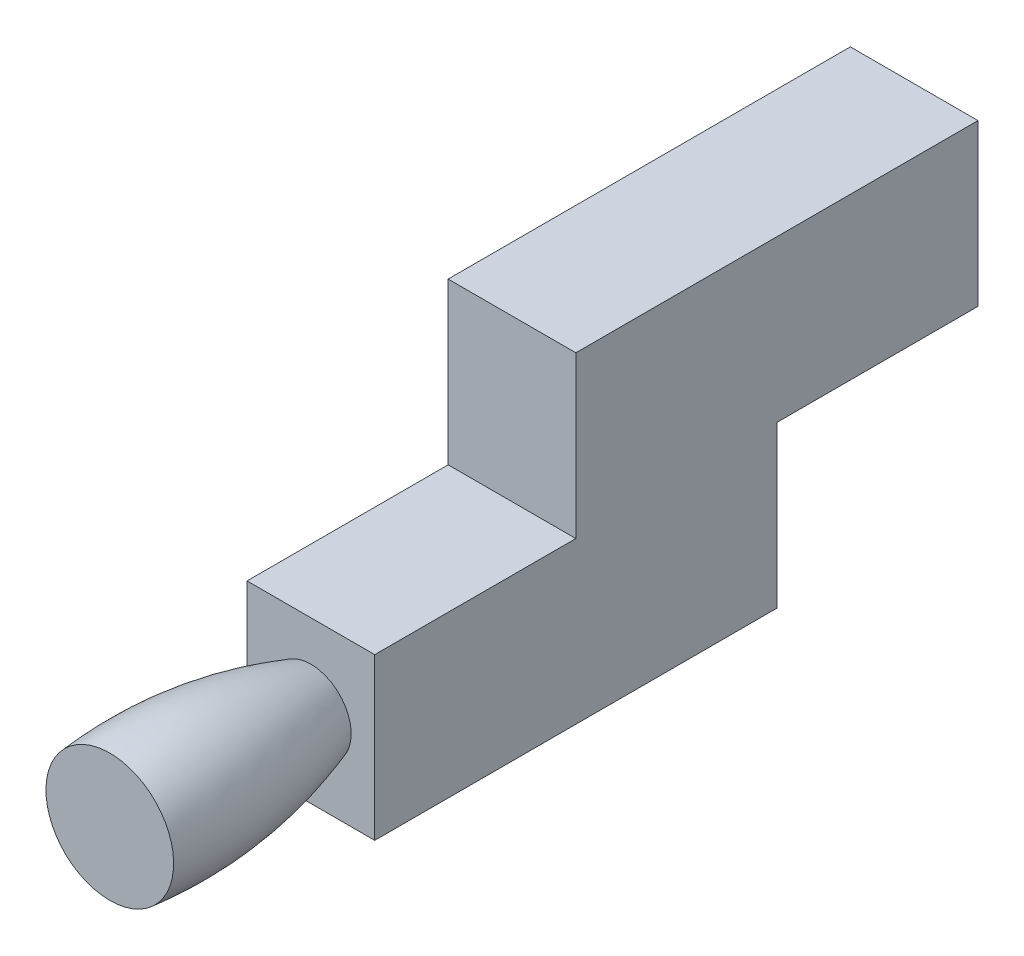
ISO-10303-21;
HEADER;
FILE_DESCRIPTION(('STEP AP214'),'2;1');
FILE_NAME('part.step','',(''),(''),'','','');
FILE_SCHEMA(('AUTOMOTIVE_DESIGN { 1 0 10303 214 1 1 1 1 }'));
ENDSEC;
DATA;
#1=APPLICATION_CONTEXT('core data for automotive mechanical design processes');
#2=APPLICATION_PROTOCOL_DEFINITION('international standard','automotive_design',2000,#1);
#3=PRODUCT_CONTEXT('',#1,'mechanical');
#4=PRODUCT('Part','Part','',(#3));
#5=PRODUCT_RELATED_PRODUCT_CATEGORY('part','',(#4));
#6=PRODUCT_DEFINITION_FORMATION('','',#4);
#7=PRODUCT_DEFINITION_CONTEXT('part definition',#1,'design');
#8=PRODUCT_DEFINITION('design','',#6,#7);
#9=PRODUCT_DEFINITION_SHAPE('','',#8);
#10=(LENGTH_UNIT() NAMED_UNIT(*) SI_UNIT(.MILLI.,.METRE.));
#11=(NAMED_UNIT(*) PLANE_ANGLE_UNIT() SI_UNIT($,.RADIAN.));
#12=(NAMED_UNIT(*) SI_UNIT($,.STERADIAN.) SOLID_ANGLE_UNIT());
#13=UNCERTAINTY_MEASURE_WITH_UNIT(LENGTH_MEASURE(1.E-05),#10,'distance_accuracy_value','');
#14=(GEOMETRIC_REPRESENTATION_CONTEXT(3) GLOBAL_UNCERTAINTY_ASSIGNED_CONTEXT((#13)) GLOBAL_UNIT_ASSIGNED_CONTEXT((#10,
#11,#12)) REPRESENTATION_CONTEXT('',''));
#15=CARTESIAN_POINT('',(0.,0.,0.));
#16=DIRECTION('',(0.,0.,1.));
#17=DIRECTION('',(1.,0.,0.));
#18=AXIS2_PLACEMENT_3D('',#15,#16,#17);
#19=CARTESIAN_POINT('',(0.,0.,5.));
#20=DIRECTION('',(0.,0.,1.));
#21=DIRECTION('',(1.,0.,0.));
#22=AXIS2_PLACEMENT_3D('',#19,#20,#21);
#23=PLANE('',#22);
#24=DIRECTION('',(0.,-1.,0.));
#25=VECTOR('',#24,1.);
#26=CARTESIAN_POINT('',(-0.803970647342905,-1.85226721623948,5.));
#27=LINE('',#26,#25);
#28=CARTESIAN_POINT('',(-0.803970647342905,-1.85226721623948,5.));
#29=VERTEX_POINT('',#28);
#30=CARTESIAN_POINT('',(-0.803970647342905,-5.85226721623948,5.));
#31=VERTEX_POINT('',#30);
#32=EDGE_CURVE('E179',#29,#31,#27,.T.);
#33=ORIENTED_EDGE('',*,*,#32,.T.);
#34=DIRECTION('',(1.,0.,0.));
#35=VECTOR('',#34,1.);
#36=CARTESIAN_POINT('',(-0.803970647342905,-5.85226721623948,5.));
#37=LINE('',#36,#35);
#38=CARTESIAN_POINT('',(2.37102935265709,-5.85226721623948,5.));
#39=VERTEX_POINT('',#38);
#40=EDGE_CURVE('E168',#31,#39,#37,.T.);
#41=ORIENTED_EDGE('',*,*,#40,.T.);
#42=DIRECTION('',(0.,1.,0.));
#43=VECTOR('',#42,1.);
#44=CARTESIAN_POINT('',(2.37102935265709,-1.85226721623948,5.));
#45=LINE('',#44,#43);
#46=CARTESIAN_POINT('',(2.37102935265709,-1.85226721623948,5.));
#47=VERTEX_POINT('',#46);
#48=EDGE_CURVE('E178',#39,#47,#45,.T.);
#49=ORIENTED_EDGE('',*,*,#48,.T.);
#50=DIRECTION('',(-1.,0.,0.));
#51=VECTOR('',#50,1.);
#52=CARTESIAN_POINT('',(-0.803970647342905,-1.85226721623948,5.));
#53=LINE('',#52,#51);
#54=EDGE_CURVE('E184',#47,#29,#53,.T.);
#55=ORIENTED_EDGE('',*,*,#54,.T.);
#56=EDGE_LOOP('',(#33,#41,#49,#55));
#57=FACE_BOUND('',#56,.T.);
#58=CARTESIAN_POINT('',(0.00923727879561479,-3.21824564307174,5.00000000000001));
#59=CARTESIAN_POINT('',(0.0450398333069202,-3.17451698416893,5.));
#60=CARTESIAN_POINT('',(0.0847550880601475,-3.13402880923712,5.));
#61=CARTESIAN_POINT('',(0.170530826366889,-3.0602365633723,5.));
#62=CARTESIAN_POINT('',(0.216607130597872,-3.02695095319399,5.));
#63=CARTESIAN_POINT('',(0.313475834661046,-2.96844564661302,5.));
#64=CARTESIAN_POINT('',(0.364258301595154,-2.94320943978326,5.));
#65=CARTESIAN_POINT('',(0.469251045948581,-2.90145898026304,5.));
#66=CARTESIAN_POINT('',(0.523456262301599,-2.88493217257837,5.));
#67=CARTESIAN_POINT('',(0.60666277098532,-2.86717672723652,5.));
#68=CARTESIAN_POINT('',(0.634946174302572,-2.86242183546317,5.));
#69=CARTESIAN_POINT('',(0.691826244745942,-2.85548191807134,5.));
#70=CARTESIAN_POINT('',(0.72042290325093,-2.85329682190768,5.));
#71=CARTESIAN_POINT('',(0.806356971453538,-2.85056168991217,5.));
#72=CARTESIAN_POINT('',(0.863853981057259,-2.85382853644774,5.));
#73=CARTESIAN_POINT('',(0.975033164307306,-2.86963264291561,5.));
#74=CARTESIAN_POINT('',(1.02877409364747,-2.8817743822195,5.));
#75=CARTESIAN_POINT('',(1.13364167369814,-2.91443586531483,5.));
#76=CARTESIAN_POINT('',(1.18476854845911,-2.93495488973056,5.));
#77=CARTESIAN_POINT('',(1.28556252189465,-2.98527427329888,5.));
#78=CARTESIAN_POINT('',(1.33502521245143,-3.01549134095325,5.));
#79=CARTESIAN_POINT('',(1.40450316952347,-3.06705691798666,5.));
#80=CARTESIAN_POINT('',(1.42688051170033,-3.08528974564922,5.));
#81=CARTESIAN_POINT('',(1.46989658543222,-3.12370307562737,5.));
#82=CARTESIAN_POINT('',(1.49053523715407,-3.14388366728472,5.));
#83=CARTESIAN_POINT('',(1.54768177365626,-3.20487009699664,5.));
#84=CARTESIAN_POINT('',(1.58181726085108,-3.24793851873741,5.));
#85=CARTESIAN_POINT('',(1.64281491446767,-3.33897576132739,5.));
#86=CARTESIAN_POINT('',(1.66966879315488,-3.38695008116108,5.));
#87=CARTESIAN_POINT('',(1.716532958902,-3.48893278445298,5.));
#88=CARTESIAN_POINT('',(1.73615762707549,-3.54311953746418,5.));
#89=CARTESIAN_POINT('',(1.76578415870646,-3.65401081987217,5.));
#90=CARTESIAN_POINT('',(1.77580038017345,-3.71071145966346,5.));
#91=CARTESIAN_POINT('',(1.78528710311074,-3.82345915221293,5.));
#92=CARTESIAN_POINT('',(1.78503138279401,-3.87948338881808,5.));
#93=CARTESIAN_POINT('',(1.77521413258997,-3.99071498187784,5.));
#94=CARTESIAN_POINT('',(1.76564692957116,-4.04592181950449,5.));
#95=CARTESIAN_POINT('',(1.7376863254958,-4.15410273179527,5.));
#96=CARTESIAN_POINT('',(1.71928391786027,-4.20707446792579,5.));
#97=CARTESIAN_POINT('',(1.67409083225169,-4.30928232564291,5.));
#98=CARTESIAN_POINT('',(1.64730981352751,-4.35852266815901,5.));
#99=CARTESIAN_POINT('',(1.60084368846309,-4.42901164089203,5.));
#100=CARTESIAN_POINT('',(1.58405789565584,-4.45221038093529,5.));
#101=CARTESIAN_POINT('',(1.54847799698699,-4.49701017745798,5.));
#102=CARTESIAN_POINT('',(1.52968404160665,-4.51861135344557,5.));
#103=CARTESIAN_POINT('',(1.47054417183962,-4.58083079665835,5.));
#104=CARTESIAN_POINT('',(1.42743415687832,-4.61887417546569,5.));
#105=CARTESIAN_POINT('',(1.33712329410626,-4.685959551508,5.));
#106=CARTESIAN_POINT('',(1.29012144408713,-4.71527266319695,5.));
#107=CARTESIAN_POINT('',(1.19204428317124,-4.76600116143626,5.));
#108=CARTESIAN_POINT('',(1.14096980451628,-4.78741815655342,5.));
#109=CARTESIAN_POINT('',(1.03365214118786,-4.82237450232142,5.));
#110=CARTESIAN_POINT('',(0.977280650523072,-4.83552911432573,5.));
#111=CARTESIAN_POINT('',(0.89170400679566,-4.84748561891553,5.));
#112=CARTESIAN_POINT('',(0.863001299344797,-4.8501749194917,5.));
#113=CARTESIAN_POINT('',(0.805469774718007,-4.85295801263628,5.));
#114=CARTESIAN_POINT('',(0.776640950261009,-4.85305165331852,5.));
#115=CARTESIAN_POINT('',(0.693306408503972,-4.84968703708027,5.));
#116=CARTESIAN_POINT('',(0.638903241779991,-4.84297614930648,5.));
#117=CARTESIAN_POINT('',(0.531831750489037,-4.82100792499866,5.));
#118=CARTESIAN_POINT('',(0.479165315867328,-4.80574158342219,5.));
#119=CARTESIAN_POINT('',(0.374283919292881,-4.76608518451448,5.));
#120=CARTESIAN_POINT('',(0.322228184025024,-4.74127054538754,5.));
#121=CARTESIAN_POINT('',(0.223217883785208,-4.6830621903983,5.));
#122=CARTESIAN_POINT('',(0.176256027183909,-4.64968097402397,5.));
#123=CARTESIAN_POINT('',(0.0903803184011727,-4.5760664710535,5.));
#124=CARTESIAN_POINT('',(0.0512748866508327,-4.53605616344491,5.));
#125=CARTESIAN_POINT('',(-0.0198276199962001,-4.45008639903594,5.));
#126=CARTESIAN_POINT('',(-0.0518140563636663,-4.40411819889973,5.));
#127=CARTESIAN_POINT('',(-0.108097568622908,-4.30734900397755,5.));
#128=CARTESIAN_POINT('',(-0.132349619349792,-4.25652187202995,5.));
#129=CARTESIAN_POINT('',(-0.172172043133923,-4.15160146164441,5.));
#130=CARTESIAN_POINT('',(-0.187753281958004,-4.09751236560438,4.99999999999999));
#131=CARTESIAN_POINT('',(-0.204131225604347,-4.01451380012327,5.));
#132=CARTESIAN_POINT('',(-0.208431138429285,-3.98626209453653,5.));
#133=CARTESIAN_POINT('',(-0.214468437315184,-3.92948618525263,5.));
#134=CARTESIAN_POINT('',(-0.216205811326952,-3.90096198027479,5.));
#135=CARTESIAN_POINT('',(-0.217649536676011,-3.81529153094614,5.));
#136=CARTESIAN_POINT('',(-0.213587981399047,-3.75804492210662,5.));
#137=CARTESIAN_POINT('',(-0.196290993144513,-3.64715207605531,5.));
#138=CARTESIAN_POINT('',(-0.183396377645656,-3.59345072648453,5.));
#139=CARTESIAN_POINT('',(-0.149262486397128,-3.48885411236415,5.));
#140=CARTESIAN_POINT('',(-0.128033798373076,-3.43795538051452,5.));
#141=CARTESIAN_POINT('',(-0.0714650108645722,-3.32848941171724,5.));
#142=CARTESIAN_POINT('',(-0.033962084094523,-3.27100864365722,5.00000000000001));
#143=CARTESIAN_POINT('',(0.00923727879561479,-3.21824564307174,5.00000000000001));
#144=B_SPLINE_CURVE_WITH_KNOTS('',3,(#58,#59,#60,#61,#62,#63,#64,#65,#66,#67,#68,#69,#70,#71,
#72,#73,#74,#75,#76,#77,#78,#79,#80,#81,#82,#83,#84,#85,#86,#87,#88,#89,#90,#91,#92,#93,#94,#95,
#96,#97,#98,#99,#100,#101,#102,#103,#104,#105,#106,#107,#108,#109,#110,#111,#112,#113,#114,#115,
#116,#117,#118,#119,#120,#121,#122,#123,#124,#125,#126,#127,#128,#129,#130,#131,#132,#133,#134,
#135,#136,#137,#138,#139,#140,#141,#142,#143),.UNSPECIFIED.,.T.,.F.,(4,2,2,2,2,2,2,2,2,2,2,2,2,
2,2,2,2,2,2,2,2,2,2,2,2,2,2,2,2,2,2,2,2,2,2,2,2,2,2,2,2,2,4),(0.,0.169304760818923,
0.339038454078839,0.508421727489099,0.677560154639192,0.763499984884317,0.849437455882624,
1.02126553455079,1.18586962325776,1.35045958002529,1.52336885902373,1.60985838481445,
1.69635187966978,1.86043435116214,2.0247028004799,2.19677328809049,2.36858624645384,
2.53582298896264,2.7031616862684,2.8706713314674,3.03798857104247,3.12379240407714,
3.2095898119217,3.38115199246107,3.54663706394365,3.7120884047858,3.8847629388407,
3.97114314066498,4.05752839705391,4.22119766078538,4.38503951902131,4.55721523252543,
4.72914113891467,4.89615574840602,5.06341829097566,5.23163748139131,5.39964539166179,
5.48527518984084,5.57090539065446,5.74215817007147,5.90715009797727,6.07193309255494,
6.27621621987579),.UNSPECIFIED.);
#145=CARTESIAN_POINT('',(1.5572368904326,-4.48581014768877,5.));
#146=VERTEX_POINT('',#145);
#147=EDGE_CURVE('E91',#146,#146,#144,.F.);
#148=ORIENTED_EDGE('',*,*,#147,.F.);
#149=EDGE_LOOP('',(#148));
#150=FACE_BOUND('',#149,.T.);
#151=ADVANCED_FACE('F87',(#57,#150),#23,.T.);
#152=CARTESIAN_POINT('',(-0.803970647342905,-1.85226721623948,-10.));
#153=DIRECTION('',(0.,-1.,0.));
#154=DIRECTION('',(0.,0.,-1.));
#155=AXIS2_PLACEMENT_3D('',#152,#153,#154);
#156=PLANE('',#155);
#157=DIRECTION('',(0.,0.,1.));
#158=VECTOR('',#157,1.);
#159=CARTESIAN_POINT('',(2.37102935265709,-1.85226721623948,-10.));
#160=LINE('',#159,#158);
#161=CARTESIAN_POINT('',(2.37102935265709,-1.85226721623948,-10.));
#162=VERTEX_POINT('',#161);
#163=CARTESIAN_POINT('',(2.37102935265709,-1.85226721623948,-5.));
#164=VERTEX_POINT('',#163);
#165=EDGE_CURVE('E228',#162,#164,#160,.T.);
#166=ORIENTED_EDGE('',*,*,#165,.T.);
#167=DIRECTION('',(-1.,0.,0.));
#168=VECTOR('',#167,1.);
#169=CARTESIAN_POINT('',(-0.803970647342905,-1.85226721623948,-5.));
#170=LINE('',#169,#168);
#171=CARTESIAN_POINT('',(-0.803970647342905,-1.85226721623948,-5.));
#172=VERTEX_POINT('',#171);
#173=EDGE_CURVE('E188',#164,#172,#170,.T.);
#174=ORIENTED_EDGE('',*,*,#173,.T.);
#175=DIRECTION('',(0.,0.,1.));
#176=VECTOR('',#175,1.);
#177=CARTESIAN_POINT('',(-0.803970647342905,-1.85226721623948,-10.));
#178=LINE('',#177,#176);
#179=CARTESIAN_POINT('',(-0.803970647342905,-1.85226721623948,-10.));
#180=VERTEX_POINT('',#179);
#181=EDGE_CURVE('E137',#180,#172,#178,.T.);
#182=ORIENTED_EDGE('',*,*,#181,.F.);
#183=DIRECTION('',(1.,0.,0.));
#184=VECTOR('',#183,1.);
#185=CARTESIAN_POINT('',(-0.803970647342905,-1.85226721623948,-10.));
#186=LINE('',#185,#184);
#187=EDGE_CURVE('E205',#180,#162,#186,.T.);
#188=ORIENTED_EDGE('',*,*,#187,.T.);
#189=EDGE_LOOP('',(#166,#174,#182,#188));
#190=FACE_BOUND('',#189,.T.);
#191=ADVANCED_FACE('F240',(#190),#156,.T.);
#192=CARTESIAN_POINT('',(-0.803970647342905,-1.85226721623948,-10.));
#193=DIRECTION('',(-1.,0.,0.));
#194=DIRECTION('',(0.,0.,1.));
#195=AXIS2_PLACEMENT_3D('',#192,#193,#194);
#196=PLANE('',#195);
#197=DIRECTION('',(0.,-1.,0.));
#198=VECTOR('',#197,1.);
#199=CARTESIAN_POINT('',(-0.803970647342905,-1.85226721623948,0.));
#200=LINE('',#199,#198);
#201=CARTESIAN_POINT('',(-0.803970647342905,2.14773278376052,0.));
#202=VERTEX_POINT('',#201);
#203=CARTESIAN_POINT('',(-0.803970647342905,-1.85226721623948,0.));
#204=VERTEX_POINT('',#203);
#205=EDGE_CURVE('E191',#202,#204,#200,.T.);
#206=ORIENTED_EDGE('',*,*,#205,.F.);
#207=DIRECTION('',(0.,0.,1.));
#208=VECTOR('',#207,1.);
#209=CARTESIAN_POINT('',(-0.803970647342905,2.14773278376052,-10.));
#210=LINE('',#209,#208);
#211=CARTESIAN_POINT('',(-0.803970647342905,2.14773278376052,-10.));
#212=VERTEX_POINT('',#211);
#213=EDGE_CURVE('E12',#212,#202,#210,.T.);
#214=ORIENTED_EDGE('',*,*,#213,.F.);
#215=DIRECTION('',(0.,-1.,0.));
#216=VECTOR('',#215,1.);
#217=CARTESIAN_POINT('',(-0.803970647342905,-1.85226721623948,-10.));
#218=LINE('',#217,#216);
#219=EDGE_CURVE('E202',#212,#180,#218,.T.);
#220=ORIENTED_EDGE('',*,*,#219,.T.);
#221=ORIENTED_EDGE('',*,*,#181,.T.);
#222=DIRECTION('',(0.,-1.,0.));
#223=VECTOR('',#222,1.);
#224=CARTESIAN_POINT('',(-0.803970647342905,-1.85226721623948,-5.));
#225=LINE('',#224,#223);
#226=CARTESIAN_POINT('',(-0.803970647342905,-5.85226721623948,-5.));
#227=VERTEX_POINT('',#226);
#228=EDGE_CURVE('E110',#172,#227,#225,.T.);
#229=ORIENTED_EDGE('',*,*,#228,.T.);
#230=DIRECTION('',(0.,0.,-1.));
#231=VECTOR('',#230,1.);
#232=CARTESIAN_POINT('',(-0.803970647342905,-5.85226721623948,5.));
#233=LINE('',#232,#231);
#234=EDGE_CURVE('E172',#31,#227,#233,.T.);
#235=ORIENTED_EDGE('',*,*,#234,.F.);
#236=ORIENTED_EDGE('',*,*,#32,.F.);
#237=DIRECTION('',(0.,0.,-1.));
#238=VECTOR('',#237,1.);
#239=CARTESIAN_POINT('',(-0.803970647342905,-1.85226721623948,5.));
#240=LINE('',#239,#238);
#241=EDGE_CURVE('E250',#29,#204,#240,.T.);
#242=ORIENTED_EDGE('',*,*,#241,.T.);
#243=EDGE_LOOP('',(#206,#214,#220,#221,#229,#235,#236,#242));
#244=FACE_BOUND('',#243,.T.);
#245=ADVANCED_FACE('F89',(#244),#196,.T.);
#246=CARTESIAN_POINT('',(-0.803970647342905,2.14773278376052,-10.));
#247=DIRECTION('',(0.,1.,0.));
#248=DIRECTION('',(0.,0.,1.));
#249=AXIS2_PLACEMENT_3D('',#246,#247,#248);
#250=PLANE('',#249);
#251=DIRECTION('',(-1.,0.,0.));
#252=VECTOR('',#251,1.);
#253=CARTESIAN_POINT('',(-0.803970647342905,2.14773278376052,0.));
#254=LINE('',#253,#252);
#255=CARTESIAN_POINT('',(2.37102935265709,2.14773278376052,0.));
#256=VERTEX_POINT('',#255);
#257=EDGE_CURVE('E206',#256,#202,#254,.T.);
#258=ORIENTED_EDGE('',*,*,#257,.F.);
#259=DIRECTION('',(0.,0.,1.));
#260=VECTOR('',#259,1.);
#261=CARTESIAN_POINT('',(2.37102935265709,2.14773278376052,-10.));
#262=LINE('',#261,#260);
#263=CARTESIAN_POINT('',(2.37102935265709,2.14773278376052,-10.));
#264=VERTEX_POINT('',#263);
#265=EDGE_CURVE('E102',#264,#256,#262,.T.);
#266=ORIENTED_EDGE('',*,*,#265,.F.);
#267=DIRECTION('',(-1.,0.,0.));
#268=VECTOR('',#267,1.);
#269=CARTESIAN_POINT('',(-0.803970647342905,2.14773278376052,-10.));
#270=LINE('',#269,#268);
#271=EDGE_CURVE('E213',#264,#212,#270,.T.);
#272=ORIENTED_EDGE('',*,*,#271,.T.);
#273=ORIENTED_EDGE('',*,*,#213,.T.);
#274=EDGE_LOOP('',(#258,#266,#272,#273));
#275=FACE_BOUND('',#274,.T.);
#276=ADVANCED_FACE('F236',(#275),#250,.T.);
#277=CARTESIAN_POINT('',(2.37102935265709,-1.85226721623948,-10.));
#278=DIRECTION('',(1.,0.,0.));
#279=DIRECTION('',(0.,0.,-1.));
#280=AXIS2_PLACEMENT_3D('',#277,#278,#279);
#281=PLANE('',#280);
#282=DIRECTION('',(0.,1.,0.));
#283=VECTOR('',#282,1.);
#284=CARTESIAN_POINT('',(2.37102935265709,-1.85226721623948,0.));
#285=LINE('',#284,#283);
#286=CARTESIAN_POINT('',(2.37102935265709,-1.85226721623948,0.));
#287=VERTEX_POINT('',#286);
#288=EDGE_CURVE('E219',#287,#256,#285,.T.);
#289=ORIENTED_EDGE('',*,*,#288,.F.);
#290=DIRECTION('',(0.,0.,-1.));
#291=VECTOR('',#290,1.);
#292=CARTESIAN_POINT('',(2.37102935265709,-1.85226721623948,5.));
#293=LINE('',#292,#291);
#294=EDGE_CURVE('E198',#47,#287,#293,.T.);
#295=ORIENTED_EDGE('',*,*,#294,.F.);
#296=ORIENTED_EDGE('',*,*,#48,.F.);
#297=DIRECTION('',(0.,0.,-1.));
#298=VECTOR('',#297,1.);
#299=CARTESIAN_POINT('',(2.37102935265709,-5.85226721623948,5.));
#300=LINE('',#299,#298);
#301=CARTESIAN_POINT('',(2.37102935265709,-5.85226721623948,-5.));
#302=VERTEX_POINT('',#301);
#303=EDGE_CURVE('E174',#39,#302,#300,.T.);
#304=ORIENTED_EDGE('',*,*,#303,.T.);
#305=DIRECTION('',(0.,1.,0.));
#306=VECTOR('',#305,1.);
#307=CARTESIAN_POINT('',(2.37102935265709,-1.85226721623948,-5.));
#308=LINE('',#307,#306);
#309=EDGE_CURVE('E243',#302,#164,#308,.T.);
#310=ORIENTED_EDGE('',*,*,#309,.T.);
#311=ORIENTED_EDGE('',*,*,#165,.F.);
#312=DIRECTION('',(0.,1.,0.));
#313=VECTOR('',#312,1.);
#314=CARTESIAN_POINT('',(2.37102935265709,-1.85226721623948,-10.));
#315=LINE('',#314,#313);
#316=EDGE_CURVE('E209',#162,#264,#315,.T.);
#317=ORIENTED_EDGE('',*,*,#316,.T.);
#318=ORIENTED_EDGE('',*,*,#265,.T.);
#319=EDGE_LOOP('',(#289,#295,#296,#304,#310,#311,#317,#318));
#320=FACE_BOUND('',#319,.T.);
#321=ADVANCED_FACE('F239',(#320),#281,.T.);
#322=CARTESIAN_POINT('',(0.,0.,-10.));
#323=DIRECTION('',(0.,0.,-1.));
#324=DIRECTION('',(-1.,0.,0.));
#325=AXIS2_PLACEMENT_3D('',#322,#323,#324);
#326=PLANE('',#325);
#327=ORIENTED_EDGE('',*,*,#219,.F.);
#328=ORIENTED_EDGE('',*,*,#271,.F.);
#329=ORIENTED_EDGE('',*,*,#316,.F.);
#330=ORIENTED_EDGE('',*,*,#187,.F.);
#331=EDGE_LOOP('',(#327,#328,#329,#330));
#332=FACE_BOUND('',#331,.T.);
#333=ADVANCED_FACE('F234',(#332),#326,.T.);
#334=CARTESIAN_POINT('',(0.,0.,0.));
#335=DIRECTION('',(0.,0.,-1.));
#336=DIRECTION('',(-1.,0.,0.));
#337=AXIS2_PLACEMENT_3D('',#334,#335,#336);
#338=PLANE('',#337);
#339=ORIENTED_EDGE('',*,*,#205,.T.);
#340=DIRECTION('',(1.,0.,0.));
#341=VECTOR('',#340,1.);
#342=CARTESIAN_POINT('',(-0.803970647342905,-1.85226721623948,0.));
#343=LINE('',#342,#341);
#344=EDGE_CURVE('E196',#204,#287,#343,.T.);
#345=ORIENTED_EDGE('',*,*,#344,.T.);
#346=ORIENTED_EDGE('',*,*,#288,.T.);
#347=ORIENTED_EDGE('',*,*,#257,.T.);
#348=EDGE_LOOP('',(#339,#345,#346,#347));
#349=FACE_BOUND('',#348,.T.);
#350=ADVANCED_FACE('F257',(#349),#338,.F.);
#351=CARTESIAN_POINT('',(-0.803970647342905,-5.85226721623948,5.));
#352=DIRECTION('',(0.,1.,0.));
#353=DIRECTION('',(0.,0.,1.));
#354=AXIS2_PLACEMENT_3D('',#351,#352,#353);
#355=PLANE('',#354);
#356=DIRECTION('',(1.,0.,0.));
#357=VECTOR('',#356,1.);
#358=CARTESIAN_POINT('',(-0.803970647342905,-5.85226721623948,-5.));
#359=LINE('',#358,#357);
#360=EDGE_CURVE('E246',#227,#302,#359,.T.);
#361=ORIENTED_EDGE('',*,*,#360,.T.);
#362=ORIENTED_EDGE('',*,*,#303,.F.);
#363=ORIENTED_EDGE('',*,*,#40,.F.);
#364=ORIENTED_EDGE('',*,*,#234,.T.);
#365=EDGE_LOOP('',(#361,#362,#363,#364));
#366=FACE_BOUND('',#365,.T.);
#367=ADVANCED_FACE('F170',(#366),#355,.F.);
#368=CARTESIAN_POINT('',(-0.803970647342905,-1.85226721623948,5.));
#369=DIRECTION('',(0.,-1.,0.));
#370=DIRECTION('',(0.,0.,-1.));
#371=AXIS2_PLACEMENT_3D('',#368,#369,#370);
#372=PLANE('',#371);
#373=ORIENTED_EDGE('',*,*,#344,.F.);
#374=ORIENTED_EDGE('',*,*,#241,.F.);
#375=ORIENTED_EDGE('',*,*,#54,.F.);
#376=ORIENTED_EDGE('',*,*,#294,.T.);
#377=EDGE_LOOP('',(#373,#374,#375,#376));
#378=FACE_BOUND('',#377,.T.);
#379=ADVANCED_FACE('F255',(#378),#372,.F.);
#380=CARTESIAN_POINT('',(0.,0.,-5.));
#381=DIRECTION('',(0.,0.,1.));
#382=DIRECTION('',(1.,0.,0.));
#383=AXIS2_PLACEMENT_3D('',#380,#381,#382);
#384=PLANE('',#383);
#385=ORIENTED_EDGE('',*,*,#228,.F.);
#386=ORIENTED_EDGE('',*,*,#173,.F.);
#387=ORIENTED_EDGE('',*,*,#309,.F.);
#388=ORIENTED_EDGE('',*,*,#360,.F.);
#389=EDGE_LOOP('',(#385,#386,#387,#388));
#390=FACE_BOUND('',#389,.T.);
#391=ADVANCED_FACE('F276',(#390),#384,.F.);
#392=CARTESIAN_POINT('',(0.783529352657095,-3.85226721623948,10.));
#393=DIRECTION('',(0.,0.,1.));
#394=DIRECTION('',(1.,0.,0.));
#395=AXIS2_PLACEMENT_3D('',#392,#393,#394);
#396=PLANE('',#395);
#397=CARTESIAN_POINT('',(0.783529352657095,-3.85226721623948,10.));
#398=DIRECTION('',(0.,0.,1.));
#399=DIRECTION('',(1.,0.,0.));
#400=AXIS2_PLACEMENT_3D('',#397,#398,#399);
#401=CIRCLE('',#400,1.5875);
#402=CARTESIAN_POINT('',(2.2016070085962,-4.56585814368058,10.));
#403=VERTEX_POINT('',#402);
#404=EDGE_CURVE('E387',#403,#403,#401,.T.);
#405=ORIENTED_EDGE('',*,*,#404,.T.);
#406=EDGE_LOOP('',(#405));
#407=FACE_BOUND('',#406,.T.);
#408=ADVANCED_FACE('F274',(#407),#396,.T.);
#409=CARTESIAN_POINT('',(1.5572368904326,-4.48581014768877,5.));
#410=CARTESIAN_POINT('',(1.80738981158281,-4.62606254933223,5.82320395812726));
#411=CARTESIAN_POINT('',(2.1637193170035,-4.77952064568989,7.47012577957998));
#412=CARTESIAN_POINT('',(2.23696989035855,-4.67942787999343,9.15653729146059));
#413=CARTESIAN_POINT('',(2.2016070085962,-4.56585814368058,10.));
#414=CARTESIAN_POINT('',(1.64016746121177,-4.38453207395652,5.));
#415=CARTESIAN_POINT('',(1.90871251637712,-4.49200137631227,5.82320558731624));
#416=CARTESIAN_POINT('',(2.28507527298629,-4.59887881683171,7.4701241499217));
#417=CARTESIAN_POINT('',(2.34525482268315,-4.48916130082147,9.15653892064958));
#418=CARTESIAN_POINT('',(2.29501583691372,-4.38023222382826,10.));
#419=CARTESIAN_POINT('',(1.76411421280383,-4.14820183120233,5.));
#420=CARTESIAN_POINT('',(2.0571152623836,-4.18337491266711,5.82313934973642));
#421=CARTESIAN_POINT('',(2.45628654338434,-4.18945759941979,7.47019040658142));
#422=CARTESIAN_POINT('',(2.48640119466015,-4.06583178739913,9.15647268306976));
#423=CARTESIAN_POINT('',(2.40802690638145,-3.97190558542965,10.));
#424=CARTESIAN_POINT('',(1.80624296592137,-3.75070040050191,4.99999999999999));
#425=CARTESIAN_POINT('',(2.0886694572422,-3.67092868358398,5.8232690029219));
#426=CARTESIAN_POINT('',(2.45740817294963,-3.52372350445086,7.47006071604902));
#427=CARTESIAN_POINT('',(2.43794850172335,-3.3979429393429,9.15660233625523));
#428=CARTESIAN_POINT('',(2.33016587520893,-3.34121684202581,9.99999999999999));
#429=CARTESIAN_POINT('',(1.68653214039658,-3.36850912253231,5.));
#430=CARTESIAN_POINT('',(1.91836851386545,-3.18588881514388,5.82313017414038));
#431=CARTESIAN_POINT('',(2.20464269450491,-2.90758512939207,7.47019958482053));
#432=CARTESIAN_POINT('',(2.13849570408028,-2.7988477460841,9.15646350747372));
#433=CARTESIAN_POINT('',(2.01672176029269,-2.78794884527127,10.));
#434=CARTESIAN_POINT('',(1.43454088722417,-3.05699251568305,5.));
#435=CARTESIAN_POINT('',(1.57797589745275,-2.80113581530255,5.82328094487644));
#436=CARTESIAN_POINT('',(1.73480792376786,-2.43663805322991,7.47004877065457));
#437=CARTESIAN_POINT('',(1.63212993523157,-2.36146733366902,9.15661427820975));
#438=CARTESIAN_POINT('',(1.5157722630311,-2.39748943003275,9.99999999999999));
#439=CARTESIAN_POINT('',(1.13894711236973,-2.90242800123357,5.));
#440=CARTESIAN_POINT('',(1.19193176740745,-2.61541941982546,5.82314370698217));
#441=CARTESIAN_POINT('',(1.22286628622089,-2.2217973431084,7.47018604808056));
#442=CARTESIAN_POINT('',(1.10268219340049,-2.18418192036594,9.15647704031552));
#443=CARTESIAN_POINT('',(1.00507271194185,-2.25557179690381,10.));
#444=CARTESIAN_POINT('',(0.880774468018493,-2.85062362208929,5.));
#445=CARTESIAN_POINT('',(0.858505984021978,-2.56332720930738,5.82324044262762));
#446=CARTESIAN_POINT('',(0.788030493863905,-2.17995531431705,7.47008928457018));
#447=CARTESIAN_POINT('',(0.663388654770276,-2.17459934532132,9.15657377596096));
#448=CARTESIAN_POINT('',(0.588098481264571,-2.26753181800305,10.));
#449=CARTESIAN_POINT('',(0.486649383953356,-2.84917810461833,5.));
#450=CARTESIAN_POINT('',(0.352165398479023,-2.58028723358923,5.8231354656978));
#451=CARTESIAN_POINT('',(0.133373544897485,-2.23739175029746,7.47019429173883));
#452=CARTESIAN_POINT('',(0.0110785433840726,-2.2810165373003,9.15646879903112));
#453=CARTESIAN_POINT('',(-0.0249809072374278,-2.40027206991351,9.99999999999998));
#454=CARTESIAN_POINT('',(-0.0746680319277114,-3.14954059119561,5.00000000000001));
#455=CARTESIAN_POINT('',(-0.351293254865972,-2.99458010193778,5.82326082089446));
#456=CARTESIAN_POINT('',(-0.74536508838576,-2.8251319641009,7.47006890043333));
#457=CARTESIAN_POINT('',(-0.826526681725305,-2.93601991679377,9.15659415422778));
#458=CARTESIAN_POINT('',(-0.787518172216711,-3.06170031347961,10.));
#459=CARTESIAN_POINT('',(-0.258411549553811,-3.75907581121548,4.99999999999999));
#460=CARTESIAN_POINT('',(-0.557912947827052,-3.78446682674471,5.82315057615863));
#461=CARTESIAN_POINT('',(-0.957273557065504,-3.86079530280045,7.47017917692542));
#462=CARTESIAN_POINT('',(-0.96184008735478,-3.99055392720041,9.15648390949196));
#463=CARTESIAN_POINT('',(-0.864302250297045,-4.06820645217045,9.99999999999999));
#464=CARTESIAN_POINT('',(-0.179254555507575,-4.14517274425649,5.));
#465=CARTESIAN_POINT('',(-0.435999502096793,-4.27616665466236,5.82323045967339));
#466=CARTESIAN_POINT('',(-0.762998646596764,-4.48862149839849,7.47009927039999));
#467=CARTESIAN_POINT('',(-0.72021286362896,-4.60581732958632,9.15656379300674));
#468=CARTESIAN_POINT('',(-0.605574604929456,-4.63964876474958,10.));
#469=CARTESIAN_POINT('',(-0.0775442270507347,-4.38805505541775,5.));
#470=CARTESIAN_POINT('',(-0.294879774480191,-4.58278054584695,5.82314933458924));
#471=CARTESIAN_POINT('',(-0.559887846855747,-4.87532655933422,7.47018041885245));
#472=CARTESIAN_POINT('',(-0.487656409235113,-4.97849981324653,9.15648266792258));
#473=CARTESIAN_POINT('',(-0.366709139765689,-4.9816339116576,10.));
#474=CARTESIAN_POINT('',(0.132288593886059,-4.6473542187743,5.00000000000001));
#475=CARTESIAN_POINT('',(-0.0109088125220108,-4.90339266469539,5.82327518771956));
#476=CARTESIAN_POINT('',(-0.167417182997043,-5.2681296200003,7.47005452946981));
#477=CARTESIAN_POINT('',(-0.0647141563330804,-5.34328484603673,9.15660852105289));
#478=CARTESIAN_POINT('',(0.0515802590307586,-5.30719285398633,9.99999999999998));
#479=CARTESIAN_POINT('',(0.487389554209685,-4.83294919714256,5.));
#480=CARTESIAN_POINT('',(0.452236396058822,-5.12592111836735,5.82313568577393));
#481=CARTESIAN_POINT('',(0.446116308744599,-5.52502073775241,7.47019407159935));
#482=CARTESIAN_POINT('',(0.569746218513943,-5.5551683037434,9.15646901910727));
#483=CARTESIAN_POINT('',(0.6636554533185,-5.476818648878,10.));
#484=CARTESIAN_POINT('',(0.885684823916184,-4.87492219838495,4.99999999999999));
#485=CARTESIAN_POINT('',(0.965233421116434,-5.15736670893804,5.82327467397391));
#486=CARTESIAN_POINT('',(1.1121688089168,-5.52611962731337,7.47005504336342));
#487=CARTESIAN_POINT('',(1.2379428088203,-5.50664812379254,9.15660800730725));
#488=CARTESIAN_POINT('',(1.29474456290614,-5.3988492627812,9.99999999999998));
#489=CARTESIAN_POINT('',(1.26706713718896,-4.75521526303521,5.));
#490=CARTESIAN_POINT('',(1.44971538267787,-4.98708694022624,5.82312957460249));
#491=CARTESIAN_POINT('',(1.72800210741665,-5.27346920109773,7.47020018453111));
#492=CARTESIAN_POINT('',(1.83674413550885,-5.20732686309236,9.15646290793583));
#493=CARTESIAN_POINT('',(1.84762647127263,-5.08555670520507,10.));
#494=CARTESIAN_POINT('',(1.47430631965343,-4.58708822142102,5.));
#495=CARTESIAN_POINT('',(1.7060671067885,-4.76012372235218,5.82320232893827));
#496=CARTESIAN_POINT('',(2.04236336102071,-4.96016247454808,7.47012740923826));
#497=CARTESIAN_POINT('',(2.12868495803394,-4.86969445916539,9.1565356622716));
#498=CARTESIAN_POINT('',(2.10819818027868,-4.75148406353291,10.));
#499=CARTESIAN_POINT('',(1.5572368904326,-4.48581014768877,5.));
#500=CARTESIAN_POINT('',(1.80738981158281,-4.62606254933223,5.82320395812726));
#501=CARTESIAN_POINT('',(2.1637193170035,-4.77952064568989,7.47012577957998));
#502=CARTESIAN_POINT('',(2.23696989035855,-4.67942787999343,9.15653729146059));
#503=CARTESIAN_POINT('',(2.2016070085962,-4.56585814368058,10.));
#504=B_SPLINE_SURFACE_WITH_KNOTS('',3,3,((#409,#410,#411,#412,#413),(#414,#415,#416,#417,#418),
(#419,#420,#421,#422,#423),(#424,#425,#426,#427,#428),(#429,#430,#431,#432,#433),(#434,#435,
#436,#437,#438),(#439,#440,#441,#442,#443),(#444,#445,#446,#447,#448),(#449,#450,#451,#452,
#453),(#454,#455,#456,#457,#458),(#459,#460,#461,#462,#463),(#464,#465,#466,#467,#468),(#469,
#470,#471,#472,#473),(#474,#475,#476,#477,#478),(#479,#480,#481,#482,#483),(#484,#485,#486,#487,
#488),(#489,#490,#491,#492,#493),(#494,#495,#496,#497,#498),(#499,#500,#501,#502,#503)),
.UNSPECIFIED.,.T.,.F.,.F.,(4,1,1,1,1,1,1,1,1,1,1,1,1,1,1,1,4),(4,1,4),(0.,0.0625,0.125,0.1875,
0.25,0.3125,0.34375,0.375,0.5,0.625,0.65625,0.6875,0.75,0.8125,0.875,0.9375,1.),(0.,
0.506000112839217,1.),.UNSPECIFIED.);
#505=CARTESIAN_POINT('',(1.5572368904326,-4.48581014768877,5.));
#506=CARTESIAN_POINT('',(1.56109778277931,-4.48797482134838,5.01270543510637));
#507=CARTESIAN_POINT('',(1.56494343997294,-4.49012536936516,5.02541790691619));
#508=CARTESIAN_POINT('',(1.5726014105635,-4.4943965809425,5.05084769413656));
#509=CARTESIAN_POINT('',(1.57641374591591,-4.49651726484869,5.06356499951817));
#510=CARTESIAN_POINT('',(1.58400505358607,-4.5007287312456,5.08900445378092));
#511=CARTESIAN_POINT('',(1.58778404762317,-4.50281953385244,5.10172659285054));
#512=CARTESIAN_POINT('',(1.59530865358611,-4.50697122087355,5.12717571398011));
#513=CARTESIAN_POINT('',(1.59905428699135,-4.50903212517113,5.13990268644542));
#514=CARTESIAN_POINT('',(1.60651215257545,-4.51312399875189,5.16536147396745));
#515=CARTESIAN_POINT('',(1.61022440599013,-4.51515498768244,5.17809327964545));
#516=CARTESIAN_POINT('',(1.61761549249294,-4.51918701372329,5.2035617331655));
#517=CARTESIAN_POINT('',(1.62129434656962,-4.52118807024184,5.21629837184387));
#518=CARTESIAN_POINT('',(1.62861861529694,-4.5251602146526,5.24177649094608));
#519=CARTESIAN_POINT('',(1.63226405068518,-4.52713132171079,5.25451796242028));
#520=CARTESIAN_POINT('',(1.63952146294061,-4.53104355039874,5.28000574669448));
#521=CARTESIAN_POINT('',(1.64313346029077,-4.5329846909491,5.29275205075786));
#522=CARTESIAN_POINT('',(1.65032397737847,-4.53683696982223,5.31824949979232));
#523=CARTESIAN_POINT('',(1.6539025173407,-4.53874812681707,5.33100063623871));
#524=CARTESIAN_POINT('',(1.66102610056471,-4.54254042178318,5.35650774962208));
#525=CARTESIAN_POINT('',(1.66457116378921,-4.54442157817486,5.36926371824514));
#526=CARTESIAN_POINT('',(1.67162777445359,-4.54815385514181,5.39478049556591));
#527=CARTESIAN_POINT('',(1.67513934159056,-4.5500049938827,5.40754129615931));
#528=CARTESIAN_POINT('',(1.68212894099937,-4.55367721875832,5.43306773700599));
#529=CARTESIAN_POINT('',(1.68560699269901,-4.5554983228008,5.44583336936331));
#530=CARTESIAN_POINT('',(1.69252954215629,-4.55911046149293,5.47136947332437));
#531=CARTESIAN_POINT('',(1.69597405906881,-4.56090151378939,5.48413993723918));
#532=CARTESIAN_POINT('',(1.70282951987862,-4.56445353220588,5.50968570390303));
#533=CARTESIAN_POINT('',(1.70624048265424,-4.5662145157087,5.52246099916884));
#534=CARTESIAN_POINT('',(1.71302881612063,-4.56970637975742,5.5480164281239));
#535=CARTESIAN_POINT('',(1.71640620540956,-4.57143727741901,5.56079655453416));
#536=CARTESIAN_POINT('',(1.72312737283659,-4.57486895300779,5.5863616453688));
#537=CARTESIAN_POINT('',(1.72647116928906,-4.57656974778056,5.59914660271695));
#538=CARTESIAN_POINT('',(1.73312513198078,-4.57994120081728,5.6247213550195));
#539=CARTESIAN_POINT('',(1.73643531624702,-4.58161187565366,5.63751114309892));
#540=CARTESIAN_POINT('',(1.7430220355075,-4.58492307204618,5.66309555645768));
#541=CARTESIAN_POINT('',(1.74629858823775,-4.58656360989859,5.67589017506171));
#542=CARTESIAN_POINT('',(1.75281802537104,-4.58981451555478,5.70148424906495));
#543=CARTESIAN_POINT('',(1.75606092721555,-4.59142489937567,5.71428369798688));
#544=CARTESIAN_POINT('',(1.76251304352573,-4.5946154802034,5.73988743222285));
#545=CARTESIAN_POINT('',(1.76572227513475,-4.59619569294524,5.75269171125592));
#546=CARTESIAN_POINT('',(1.77210703192587,-4.5993259148524,5.77830510531283));
#547=CARTESIAN_POINT('',(1.77528257394967,-4.60087593946765,5.79111421425025));
#548=CARTESIAN_POINT('',(1.7815999325258,-4.60394576836212,5.81673726771626));
#549=CARTESIAN_POINT('',(1.78474176561467,-4.60546558780327,5.8295512063512));
#550=CARTESIAN_POINT('',(1.79099168727988,-4.60847498959295,5.85518391881447));
#551=CARTESIAN_POINT('',(1.79409979208411,-4.60996458681249,5.86800268694003));
#552=CARTESIAN_POINT('',(1.80028223814248,-4.61291352740528,5.89364505798866));
#553=CARTESIAN_POINT('',(1.80335659531235,-4.61437288535573,5.90646865539793));
#554=CARTESIAN_POINT('',(1.80947152706796,-4.61726133065952,5.93212068462));
#555=CARTESIAN_POINT('',(1.81251211725381,-4.61869043229342,5.944949111106));
#556=CARTESIAN_POINT('',(1.81855949601074,-4.62151834821613,5.97061079808957));
#557=CARTESIAN_POINT('',(1.82156629986287,-4.62291717648602,5.98344405344528));
#558=CARTESIAN_POINT('',(1.82754608692522,-4.62568452893558,6.00911539777836));
#559=CARTESIAN_POINT('',(1.83051908509399,-4.62705306679401,6.02195348179673));
#560=CARTESIAN_POINT('',(1.83643124176584,-4.62975982167833,6.04763448306731));
#561=CARTESIAN_POINT('',(1.83937041490161,-4.63109805207789,6.06047739554123));
#562=CARTESIAN_POINT('',(1.84521490248706,-4.63374417530493,6.08616805333725));
#563=CARTESIAN_POINT('',(1.84812023124019,-4.63505208119821,6.09901579405959));
#564=CARTESIAN_POINT('',(1.85389701104335,-4.63763753867589,6.12471610796898));
#565=CARTESIAN_POINT('',(1.85676847606423,-4.63891510301551,6.13756867673254));
#566=CARTESIAN_POINT('',(1.86247750938921,-4.6414398606518,6.1632786463432));
#567=CARTESIAN_POINT('',(1.86531509132825,-4.64268706639039,6.17613604294074));
#568=CARTESIAN_POINT('',(1.87095633947917,-4.64515109009324,6.20185566784053));
#569=CARTESIAN_POINT('',(1.87376001898678,-4.64636792018347,6.21471789206478));
#570=CARTESIAN_POINT('',(1.87933344326777,-4.64877117586085,6.24044717184152));
#571=CARTESIAN_POINT('',(1.8821032009944,-4.64995761325538,6.25331422348518));
#572=CARTESIAN_POINT('',(1.88760876270958,-4.65230006681527,6.27905315772667));
#573=CARTESIAN_POINT('',(1.89034457930569,-4.6534560944668,6.29192503658237));
#574=CARTESIAN_POINT('',(1.89578223975921,-4.6557377118172,6.31767362487637));
#575=CARTESIAN_POINT('',(1.89848409587528,-4.65686331267844,6.33055033073672));
#576=CARTESIAN_POINT('',(1.90385381637128,-4.65908405972734,6.35630857267098));
#577=CARTESIAN_POINT('',(1.9065216926578,-4.66017921675103,6.36919010532852));
#578=CARTESIAN_POINT('',(1.91182343450044,-4.66233905940645,6.39495800049074));
#579=CARTESIAN_POINT('',(1.91445731160793,-4.66340375554535,6.407844359738));
#580=CARTESIAN_POINT('',(1.91969103610139,-4.6655026597153,6.43362190771586));
#581=CARTESIAN_POINT('',(1.92229089468039,-4.6665368779222,6.44651309334531));
#582=CARTESIAN_POINT('',(1.92745656312883,-4.66857480951471,6.47230029372646));
#583=CARTESIAN_POINT('',(1.93002238382991,-4.66957853274243,6.48519630553054));
#584=CARTESIAN_POINT('',(1.93511995753751,-4.67155545766555,6.51099315790259));
#585=CARTESIAN_POINT('',(1.93765172101126,-4.67252866886689,6.52389399567369));
#586=CARTESIAN_POINT('',(1.94268116128222,-4.67444455302867,6.54970049962424));
#587=CARTESIAN_POINT('',(1.94517884817924,-4.67538723515652,6.56260616315471));
#588=CARTESIAN_POINT('',(1.95014011631777,-4.67724204446503,6.58842231827131));
#589=CARTESIAN_POINT('',(1.9526037072887,-4.67815418047225,6.60133280735348));
#590=CARTESIAN_POINT('',(1.957496764599,-4.67994788083557,6.62715861322366));
#591=CARTESIAN_POINT('',(1.95992624029451,-4.68082945367507,6.6400739276498));
#592=CARTESIAN_POINT('',(1.96475104808082,-4.68256201100129,6.66590938386106));
#593=CARTESIAN_POINT('',(1.96714638915158,-4.68341300362601,6.67882952342341));
#594=CARTESIAN_POINT('',(1.97190290871813,-4.68508438382324,6.70467462956323));
#595=CARTESIAN_POINT('',(1.97426409581486,-4.68590477918614,6.71759959405398));
#596=CARTESIAN_POINT('',(1.9789522884659,-4.68751494816248,6.74345434970981));
#597=CARTESIAN_POINT('',(1.98127930223934,-4.68830472921656,6.75638413892113));
#598=CARTESIAN_POINT('',(1.98589912927913,-4.68985365288014,6.78224854368038));
#599=CARTESIAN_POINT('',(1.98819195038005,-4.69061280257841,6.79518315740439));
#600=CARTESIAN_POINT('',(1.99274337311286,-4.69210044683739,6.82105721085446));
#601=CARTESIAN_POINT('',(1.99500198219205,-4.69282894813289,6.83399664888325));
#602=CARTESIAN_POINT('',(1.99948496192217,-4.69425527889542,6.8598803506115));
#603=CARTESIAN_POINT('',(2.00170933963045,-4.69495311474122,6.87282461273712));
#604=CARTESIAN_POINT('',(2.00612383766218,-4.69631809791548,6.89871796233088));
#605=CARTESIAN_POINT('',(2.00831396465042,-4.6969852512647,6.91166704834536));
#606=CARTESIAN_POINT('',(2.01265994228806,-4.69828885275887,6.93757004539195));
#607=CARTESIAN_POINT('',(2.01481579920713,-4.69892530656463,6.95052395508725));
#608=CARTESIAN_POINT('',(2.01909321775502,-4.70016749228691,6.97643659917395));
#609=CARTESIAN_POINT('',(2.02121478525584,-4.70077322950238,6.98939533234203));
#610=CARTESIAN_POINT('',(2.02542360601832,-4.70195396536099,7.01531762305611));
#611=CARTESIAN_POINT('',(2.02751086475184,-4.70252896893937,7.02828117948887));
#612=CARTESIAN_POINT('',(2.03165104903325,-4.70364822084253,7.05421311641756));
#613=CARTESIAN_POINT('',(2.03370397965044,-4.70419247373705,7.0671814959069));
#614=CARTESIAN_POINT('',(2.03777548875517,-4.70525020759301,7.0931230786374));
#615=CARTESIAN_POINT('',(2.03979407190705,-4.70576369275693,7.10609628097515));
#616=CARTESIAN_POINT('',(2.04379686713947,-4.70675987447396,7.13204750909467));
#617=CARTESIAN_POINT('',(2.04578108347708,-4.70724257486057,7.14502553407265));
#618=CARTESIAN_POINT('',(2.0497151261416,-4.70817717034694,7.17098640716833));
#619=CARTESIAN_POINT('',(2.05166495631601,-4.70862906890956,7.18396925457832));
#620=CARTESIAN_POINT('',(2.05553020771704,-4.70950204407356,7.20993977223731));
#621=CARTESIAN_POINT('',(2.05744563237938,-4.70992312376556,7.22292744187107));
#622=CARTESIAN_POINT('',(2.06124205382135,-4.71073444451551,7.24890760368048));
#623=CARTESIAN_POINT('',(2.06312305362277,-4.71112468829029,7.26190009532973));
#624=CARTESIAN_POINT('',(2.0668506064101,-4.71187432053448,7.28788990087667));
#625=CARTESIAN_POINT('',(2.06869716200172,-4.71223371134541,7.3008872143331));
#626=CARTESIAN_POINT('',(2.07235580743904,-4.71292162099234,7.32688666320461));
#627=CARTESIAN_POINT('',(2.07416789947232,-4.71325014179309,7.33988879825986));
#628=CARTESIAN_POINT('',(2.07775759886346,-4.71387629475054,7.36589789004309));
#629=CARTESIAN_POINT('',(2.07953520798877,-4.71417392849381,7.37890484648893));
#630=CARTESIAN_POINT('',(2.08305592264066,-4.71473829067233,7.40492358077054));
#631=CARTESIAN_POINT('',(2.08479902951262,-4.71500502031464,7.41793535839809));
#632=CARTESIAN_POINT('',(2.08825072072069,-4.71550755761448,7.44396373476644));
#633=CARTESIAN_POINT('',(2.0899593059782,-4.71574336609825,7.45698033336909));
#634=CARTESIAN_POINT('',(2.09334193508252,-4.71618404445847,7.48301835141851));
#635=CARTESIAN_POINT('',(2.09501597942488,-4.71638891477904,7.49603977079337));
#636=CARTESIAN_POINT('',(2.09832950782331,-4.71676770001055,7.52208743195183));
#637=CARTESIAN_POINT('',(2.09996899194255,-4.71694161497807,7.53511367372657));
#638=CARTESIAN_POINT('',(2.10321338067207,-4.71725847202565,7.56117098503138));
#639=CARTESIAN_POINT('',(2.10481828490164,-4.71740141376486,7.574202054613));
#640=CARTESIAN_POINT('',(2.1079934948035,-4.71765630698942,7.60026902731189));
#641=CARTESIAN_POINT('',(2.10956379964825,-4.71776825773428,7.6133049305372));
#642=CARTESIAN_POINT('',(2.11266979170349,-4.7179611515776,7.63938157631237));
#643=CARTESIAN_POINT('',(2.11420547763796,-4.71804209353487,7.65242231902266));
#644=CARTESIAN_POINT('',(2.11724221280542,-4.71817295241884,7.67850864955959));
#645=CARTESIAN_POINT('',(2.1187432603123,-4.71822286780261,7.69155423759492));
#646=CARTESIAN_POINT('',(2.1217106995568,-4.71829165615447,7.71765026457819));
#647=CARTESIAN_POINT('',(2.12317708911665,-4.71831052717693,7.7307007037789));
#648=CARTESIAN_POINT('',(2.12607519340145,-4.71831720942252,7.7568064388933));
#649=CARTESIAN_POINT('',(2.12750690549547,-4.71830501829642,7.76986173509965));
#650=CARTESIAN_POINT('',(2.13033563578424,-4.71824955886197,7.79597719002989));
#651=CARTESIAN_POINT('',(2.13173265089351,-4.71820628779995,7.80903734908213));
#652=CARTESIAN_POINT('',(2.13449196814987,-4.71808865111162,7.83516253551293));
#653=CARTESIAN_POINT('',(2.13585426675556,-4.71801428232642,7.84822756325129));
#654=CARTESIAN_POINT('',(2.13854413194315,-4.7178344328104,7.87436249286734));
#655=CARTESIAN_POINT('',(2.13987169452647,-4.71772894851478,7.88743239513203));
#656=CARTESIAN_POINT('',(2.14249206860895,-4.7174868505973,7.91357707961801));
#657=CARTESIAN_POINT('',(2.14378487565115,-4.71735023300406,7.92665186224922));
#658=CARTESIAN_POINT('',(2.14633571959222,-4.71704585111135,7.9528063132898));
#659=CARTESIAN_POINT('',(2.14759375157459,-4.71687808243334,7.96588598212772));
#660=CARTESIAN_POINT('',(2.15007502633796,-4.71651138099166,7.99205021140755));
#661=CARTESIAN_POINT('',(2.15129826374185,-4.71631244344178,8.00513477229232));
#662=CARTESIAN_POINT('',(2.15370993029126,-4.7158833868774,8.03130879149605));
#663=CARTESIAN_POINT('',(2.15489835359806,-4.71565326266857,8.04439825026783));
#664=CARTESIAN_POINT('',(2.15724037289725,-4.71516181540781,8.07058207108007));
#665=CARTESIAN_POINT('',(2.1583939625884,-4.71490048675301,8.08367643357899));
#666=CARTESIAN_POINT('',(2.16066629560117,-4.71434661322218,8.10987006768438));
#667=CARTESIAN_POINT('',(2.16178503215815,-4.71405406233442,8.12296933975056));
#668=CARTESIAN_POINT('',(2.1639876398483,-4.71343772695988,8.14917279883369));
#669=CARTESIAN_POINT('',(2.16507150375265,-4.71311393605222,8.16227698630724));
#670=CARTESIAN_POINT('',(2.16720434708399,-4.71243510326032,8.18849028205271));
#671=CARTESIAN_POINT('',(2.16825331881728,-4.71208005454588,8.20159939077374));
#672=CARTESIAN_POINT('',(2.17031635875368,-4.71133868876301,8.22782253486613));
#673=CARTESIAN_POINT('',(2.17133041879755,-4.71095236445492,8.24093657067472));
#674=CARTESIAN_POINT('',(2.17332361630287,-4.7101484301075,8.26716957479861));
#675=CARTESIAN_POINT('',(2.17430274513899,-4.70973081241896,8.28028854353485));
#676=CARTESIAN_POINT('',(2.17622606117713,-4.70886427393341,8.30653141937482));
#677=CARTESIAN_POINT('',(2.17717023928723,-4.70841534507764,8.31965532687878));
#678=CARTESIAN_POINT('',(2.17902363482212,-4.70748616688042,8.34590808611938));
#679=CARTESIAN_POINT('',(2.17993284268796,-4.70700590907072,8.35903693823114));
#680=CARTESIAN_POINT('',(2.18171627868354,-4.70601405558829,8.38529959255692));
#681=CARTESIAN_POINT('',(2.18259049678696,-4.70550245103797,8.39843339511654));
#682=CARTESIAN_POINT('',(2.18430393420719,-4.70444788669684,8.42470595621207));
#683=CARTESIAN_POINT('',(2.18514314303005,-4.70390491761926,8.4378447150596));
#684=CARTESIAN_POINT('',(2.18678654283894,-4.70278760684594,8.46412719460942));
#685=CARTESIAN_POINT('',(2.18759072286316,-4.70221325545451,8.47727091558493));
#686=CARTESIAN_POINT('',(2.18916404602471,-4.70103316267555,8.50356332527357));
#687=CARTESIAN_POINT('',(2.18993317773227,-4.70042741118372,8.51671201421712));
#688=CARTESIAN_POINT('',(2.19143638521053,-4.69918450082568,8.54301436572911));
#689=CARTESIAN_POINT('',(2.19217044908343,-4.69854733144693,8.55616802848076));
#690=CARTESIAN_POINT('',(2.19360350184248,-4.69724156793639,8.58248033350064));
#691=CARTESIAN_POINT('',(2.19430247836279,-4.69657296288428,8.59563897590044));
#692=CARTESIAN_POINT('',(2.1956653373667,-4.69520431064785,8.62196124611275));
#693=CARTESIAN_POINT('',(2.19632920701655,-4.69450425213595,8.63512487400075));
#694=CARTESIAN_POINT('',(2.19762183322945,-4.69307267560025,8.66145712109001));
#695=CARTESIAN_POINT('',(2.19825057649099,-4.69234114584218,8.67462574030628));
#696=CARTESIAN_POINT('',(2.19947293087701,-4.69084660943386,8.70096797595702));
#697=CARTESIAN_POINT('',(2.20006652823246,-4.69008359064329,8.71414159234162));
#698=CARTESIAN_POINT('',(2.20121857175577,-4.68852605878903,8.74049382823837));
#699=CARTESIAN_POINT('',(2.20177700368739,-4.68773153317967,8.75367244763137));
#700=CARTESIAN_POINT('',(2.20285869731218,-4.68611097030615,8.78003469545866));
#701=CARTESIAN_POINT('',(2.20338194430229,-4.68528492009175,8.79321832370014));
#702=CARTESIAN_POINT('',(2.20439324899277,-4.68360129062569,8.81959059514249));
#703=CARTESIAN_POINT('',(2.20488129152372,-4.68274369802005,8.83277923807253));
#704=CARTESIAN_POINT('',(2.20582216824414,-4.68099696638818,8.85916154481448));
#705=CARTESIAN_POINT('',(2.20627498679834,-4.68010781360513,8.87235520827316));
#706=CARTESIAN_POINT('',(2.20714539651295,-4.67829794423421,8.89874756199924));
#707=CARTESIAN_POINT('',(2.20756297157287,-4.67737721348763,8.91194625182667));
#708=CARTESIAN_POINT('',(2.20836287524596,-4.67550417080445,8.93834866422142));
#709=CARTESIAN_POINT('',(2.2087451872941,-4.67455184430826,8.9515523862577));
#710=CARTESIAN_POINT('',(2.20947454588998,-4.6726155927396,8.97796486900567));
#711=CARTESIAN_POINT('',(2.2098215754089,-4.67163165270777,8.99117362909092));
#712=CARTESIAN_POINT('',(2.21048034989191,-4.66963215668046,9.01759619387664));
#713=CARTESIAN_POINT('',(2.2107920773642,-4.66861658532698,9.030809997851));
#714=CARTESIAN_POINT('',(2.21138022869872,-4.66655380926787,9.05724265635902));
#715=CARTESIAN_POINT('',(2.21165663460704,-4.66550658880679,9.07046151006263));
#716=CARTESIAN_POINT('',(2.21217412375743,-4.66338049714273,9.09690427397752));
#717=CARTESIAN_POINT('',(2.21241518858448,-4.66230160978814,9.11012818325052));
#718=CARTESIAN_POINT('',(2.21286197651516,-4.66011216694602,9.13658106425685));
#719=CARTESIAN_POINT('',(2.21306768074369,-4.65900159491204,9.14981003493943));
#720=CARTESIAN_POINT('',(2.21344372841909,-4.65674876531877,9.17627304472176));
#721=CARTESIAN_POINT('',(2.2136140525319,-4.65560649081957,9.18950708265411));
#722=CARTESIAN_POINT('',(2.21391932091649,-4.65329023890206,9.21598023289702));
#723=CARTESIAN_POINT('',(2.2140542453964,-4.65211624415185,9.22921934391934));
#724=CARTESIAN_POINT('',(2.21428869545466,-4.64973653433706,9.25570264630743));
#725=CARTESIAN_POINT('',(2.21438820078458,-4.64853080155008,9.26894683625994));
#726=CARTESIAN_POINT('',(2.214551793481,-4.64608759826496,9.2954403024778));
#727=CARTESIAN_POINT('',(2.21461586014387,-4.64485010965551,9.30868957720074));
#728=CARTESIAN_POINT('',(2.21470855644299,-4.64234337732706,9.33519321893298));
#729=CARTESIAN_POINT('',(2.21473716492178,-4.64107411510944,9.34844758426663));
#730=CARTESIAN_POINT('',(2.21475892578817,-4.63850381816466,9.37496141319787));
#731=CARTESIAN_POINT('',(2.2147520565659,-4.63720276455325,9.38822087498249));
#732=CARTESIAN_POINT('',(2.21470284296412,-4.63456886741917,9.41474490279736));
#733=CARTESIAN_POINT('',(2.21466047652387,-4.63323600462836,9.42800946687327));
#734=CARTESIAN_POINT('',(2.21454024941854,-4.63053847173202,9.45454370525642));
#735=CARTESIAN_POINT('',(2.21446236624343,-4.62917378197626,9.46781337746394));
#736=CARTESIAN_POINT('',(2.21427108659916,-4.62641257774473,9.49435783810002));
#737=CARTESIAN_POINT('',(2.21415766717236,-4.62501604323848,9.50763262427949));
#738=CARTESIAN_POINT('',(2.2138952959538,-4.62219113209884,9.53418731885318));
#739=CARTESIAN_POINT('',(2.21374632075851,-4.62076273505663,9.54746722484499));
#740=CARTESIAN_POINT('',(2.21341281893033,-4.61787408143598,9.57403216504096));
#741=CARTESIAN_POINT('',(2.21322826844981,-4.61641380407236,9.58731719668551));
#742=CARTESIAN_POINT('',(2.21282359697671,-4.61346137239782,9.61389239418846));
#743=CARTESIAN_POINT('',(2.21260345169424,-4.61196919692736,9.62718255732617));
#744=CARTESIAN_POINT('',(2.21212757154095,-4.60895295162609,9.65376802382082));
#745=CARTESIAN_POINT('',(2.21187181193989,-4.60742886026342,9.66706332429214));
#746=CARTESIAN_POINT('',(2.21132468407111,-4.60434876576254,9.69365907146321));
#747=CARTESIAN_POINT('',(2.2110332906348,-4.60279274072229,9.70695951510861));
#748=CARTESIAN_POINT('',(2.2104148760154,-4.59964876144906,9.7335655546409));
#749=CARTESIAN_POINT('',(2.21008782922738,-4.59806078494603,9.74687114730097));
#750=CARTESIAN_POINT('',(2.2093980888218,-4.59485288532737,9.773487490879));
#751=CARTESIAN_POINT('',(2.20903536916511,-4.5932329395759,9.78679823839395));
#752=CARTESIAN_POINT('',(2.20827426393938,-4.58996108404003,9.81342489770342));
#753=CARTESIAN_POINT('',(2.20787585189919,-4.58830915125625,9.82674080591507));
#754=CARTESIAN_POINT('',(2.20704334281357,-4.58497330422668,9.85337779263736));
#755=CARTESIAN_POINT('',(2.20660921886716,-4.5832893666203,9.86669886738164));
#756=CARTESIAN_POINT('',(2.2057052669036,-4.57988949253812,9.8933461932143));
#757=CARTESIAN_POINT('',(2.20523541155795,-4.57817353234291,9.90667244034925));
#758=CARTESIAN_POINT('',(2.20425997761742,-4.57470959558366,9.93333011692957));
#759=CARTESIAN_POINT('',(2.20375437126877,-4.57296159494373,9.94666154223084));
#760=CARTESIAN_POINT('',(2.20270741655496,-4.56943356012798,9.97332958142133));
#761=CARTESIAN_POINT('',(2.20216604001351,-4.56765350152252,9.98666619097253));
#762=CARTESIAN_POINT('',(2.2016070085962,-4.56585814368058,10.));
#763=B_SPLINE_CURVE_WITH_KNOTS('',3,(#505,#506,#507,#508,#509,#510,#511,#512,#513,#514,#515,
#516,#517,#518,#519,#520,#521,#522,#523,#524,#525,#526,#527,#528,#529,#530,#531,#532,#533,#534,
#535,#536,#537,#538,#539,#540,#541,#542,#543,#544,#545,#546,#547,#548,#549,#550,#551,#552,#553,
#554,#555,#556,#557,#558,#559,#560,#561,#562,#563,#564,#565,#566,#567,#568,#569,#570,#571,#572,
#573,#574,#575,#576,#577,#578,#579,#580,#581,#582,#583,#584,#585,#586,#587,#588,#589,#590,#591,
#592,#593,#594,#595,#596,#597,#598,#599,#600,#601,#602,#603,#604,#605,#606,#607,#608,#609,#610,
#611,#612,#613,#614,#615,#616,#617,#618,#619,#620,#621,#622,#623,#624,#625,#626,#627,#628,#629,
#630,#631,#632,#633,#634,#635,#636,#637,#638,#639,#640,#641,#642,#643,#644,#645,#646,#647,#648,
#649,#650,#651,#652,#653,#654,#655,#656,#657,#658,#659,#660,#661,#662,#663,#664,#665,#666,#667,
#668,#669,#670,#671,#672,#673,#674,#675,#676,#677,#678,#679,#680,#681,#682,#683,#684,#685,#686,
#687,#688,#689,#690,#691,#692,#693,#694,#695,#696,#697,#698,#699,#700,#701,#702,#703,#704,#705,
#706,#707,#708,#709,#710,#711,#712,#713,#714,#715,#716,#717,#718,#719,#720,#721,#722,#723,#724,
#725,#726,#727,#728,#729,#730,#731,#732,#733,#734,#735,#736,#737,#738,#739,#740,#741,#742,#743,
#744,#745,#746,#747,#748,#749,#750,#751,#752,#753,#754,#755,#756,#757,#758,#759,#760,#761,#762),
.UNSPECIFIED.,.F.,.F.,(4,2,2,2,2,2,2,2,2,2,2,2,2,2,2,2,2,2,2,2,2,2,2,2,2,2,2,2,2,2,2,2,2,2,2,2,
2,2,2,2,2,2,2,2,2,2,2,2,2,2,2,2,2,2,2,2,2,2,2,2,2,2,2,2,2,2,2,2,2,2,2,2,2,2,2,2,2,2,2,2,2,2,2,2,
2,2,2,2,2,2,2,2,2,2,2,2,2,2,2,2,2,2,2,2,2,2,2,2,2,2,2,2,2,2,2,2,2,2,2,2,2,2,2,2,2,2,2,2,4),(0.,
0.0403631273967304,0.080697278198297,0.121002859005802,0.161280278058789,0.201529945227867,
0.241752272007172,0.281947671506626,0.322116558443999,0.362259349136788,0.402376461493894,
0.442468315007118,0.482535330742458,0.522577931331203,0.562596540960852,0.602591585365835,
0.642563491818037,0.682512689117129,0.722439607580719,0.762344679034291,0.80222833680098,
0.842091015691133,0.881933151991687,0.921755183455366,0.961557549289676,1.00134069014572,
1.04110504810684,1.08085106667701,1.12057919076915,1.16028986669315,1.19998354214378,
1.23966066618838,1.27932168925438,1.31896706311666,1.35859724088467,1.39821267698947,
1.43781382717049,1.47740114846219,1.5169750991805,1.55653613890913,1.59608472848565,
1.63562132998749,1.67514640671768,1.71466042319046,1.75416384511679,1.79365713938958,
1.83314077406884,1.87261521836668,1.9120809426321,1.95153841833566,1.99098811805402,
2.03043051545427,2.06986608527821,2.10929530332634,2.14871864644188,2.18813659249452,
2.22754962036409,2.26695820992411,2.30636284202514,2.34576399847809,2.38516216203733,
2.42455781638372,2.46395144610754,2.50334353669121,2.54273457449201,2.58212504676184,
2.62151544702512,2.66090628073655,2.70029805554488,2.73969127992247,2.77908646314604,
2.81848411527728,2.85788474714331,2.89728887031718,2.93669699709817,2.976109640492,
3.01552731419108,3.0549505325545,3.09437981058813,3.13381566392451,3.17325860880275,
3.21270916204833,3.25216784105286,3.2916351637538,3.33111164861407,3.37059781460171,
3.41009418116937,3.4496012682339,3.4891195961558,3.52864968571869,3.56819205810873,
3.60774723489402,3.64731573800404,3.68689808970897,3.72649481259905,3.76610642956402,
3.80573346377237,3.84537643865078,3.88503587786344,3.92471230529145,3.96440624501219,
4.00411822127876,4.04384875849935,4.08359838121678,4.12336761408789,4.16315698186314,
4.20296700936614,4.24279822147324,4.28265114309318,4.3225262991468,4.36242421454679,
4.40234541417746,4.44229042287466,4.48225976540568,4.52225396644928,4.56227355057573,
4.60231904222698,4.6423909656969,4.68248984511156,4.72261620440969,4.76277056732309,
4.80295345735729,4.84316539777219,4.88340691156284,4.92367852144035,4.96398074981287,
5.00431411876668,5.04467915004742,5.08507636504144),.UNSPECIFIED.);
#764=EDGE_CURVE('BSEAM294',#146,#403,#763,.T.);
#765=ORIENTED_EDGE('',*,*,#147,.T.);
#766=ORIENTED_EDGE('',*,*,#404,.F.);
#767=ORIENTED_EDGE('',*,*,#764,.T.);
#768=ORIENTED_EDGE('',*,*,#764,.F.);
#769=EDGE_LOOP('',(#765,#767,#766,#768));
#770=FACE_BOUND('',#769,.T.);
#771=ADVANCED_FACE('F294',(#770),#504,.T.);
#772=CLOSED_SHELL('',(#151,#191,#245,#276,#321,#333,#350,#367,#379,#391,#408,#771));
#773=MANIFOLD_SOLID_BREP('B2',#772);
#774=ADVANCED_BREP_SHAPE_REPRESENTATION('',(#18,#773),#14);
#775=SHAPE_DEFINITION_REPRESENTATION(#9,#774);
ENDSEC;
END-ISO-10303-21;
